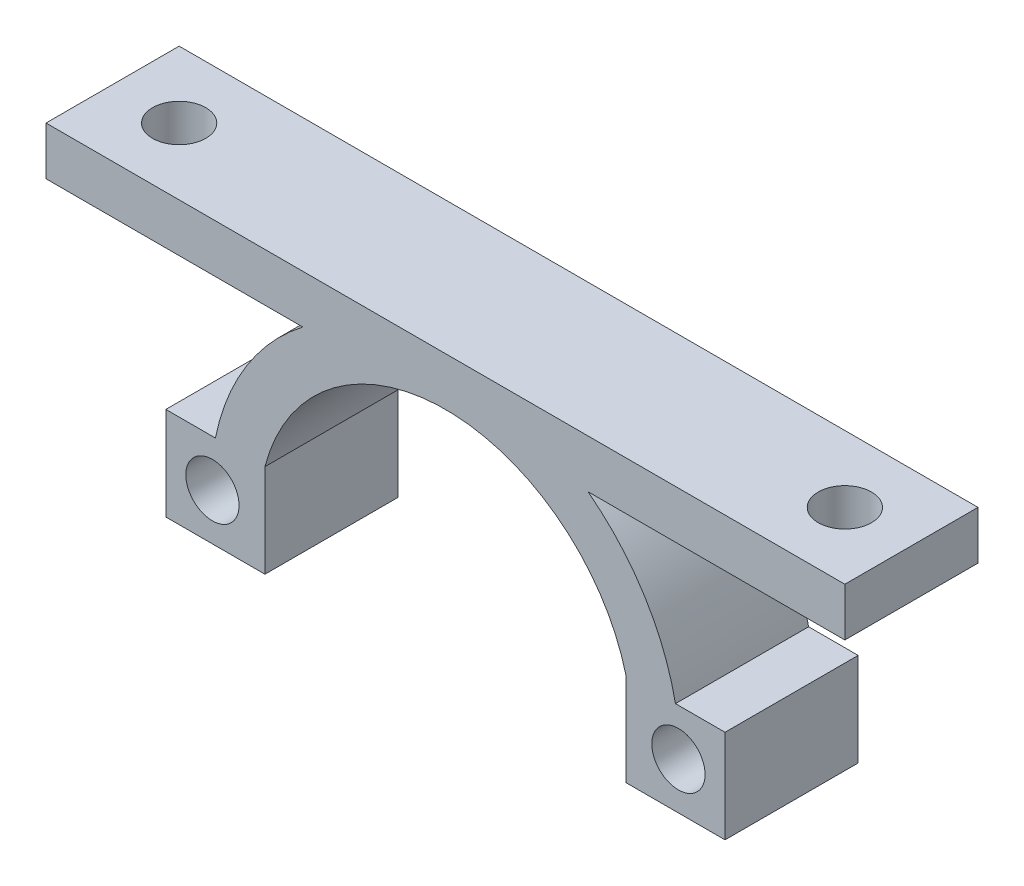
ISO-10303-21;
HEADER;
FILE_DESCRIPTION(('STEP AP214'),'2;1');
FILE_NAME('part.step','',(''),(''),'','','');
FILE_SCHEMA(('AUTOMOTIVE_DESIGN { 1 0 10303 214 1 1 1 1 }'));
ENDSEC;
DATA;
#1=APPLICATION_CONTEXT('core data for automotive mechanical design processes');
#2=APPLICATION_PROTOCOL_DEFINITION('international standard','automotive_design',2000,#1);
#3=PRODUCT_CONTEXT('',#1,'mechanical');
#4=PRODUCT('Part','Part','',(#3));
#5=PRODUCT_RELATED_PRODUCT_CATEGORY('part','',(#4));
#6=PRODUCT_DEFINITION_FORMATION('','',#4);
#7=PRODUCT_DEFINITION_CONTEXT('part definition',#1,'design');
#8=PRODUCT_DEFINITION('design','',#6,#7);
#9=PRODUCT_DEFINITION_SHAPE('','',#8);
#10=(LENGTH_UNIT() NAMED_UNIT(*) SI_UNIT(.MILLI.,.METRE.));
#11=(NAMED_UNIT(*) PLANE_ANGLE_UNIT() SI_UNIT($,.RADIAN.));
#12=(NAMED_UNIT(*) SI_UNIT($,.STERADIAN.) SOLID_ANGLE_UNIT());
#13=UNCERTAINTY_MEASURE_WITH_UNIT(LENGTH_MEASURE(1.E-05),#10,'distance_accuracy_value','');
#14=(GEOMETRIC_REPRESENTATION_CONTEXT(3) GLOBAL_UNCERTAINTY_ASSIGNED_CONTEXT((#13)) GLOBAL_UNIT_ASSIGNED_CONTEXT((#10,
#11,#12)) REPRESENTATION_CONTEXT('',''));
#15=CARTESIAN_POINT('',(0.,0.,0.));
#16=DIRECTION('',(0.,0.,1.));
#17=DIRECTION('',(1.,0.,0.));
#18=AXIS2_PLACEMENT_3D('',#15,#16,#17);
#19=CARTESIAN_POINT('',(0.,0.,10.));
#20=DIRECTION('',(0.,0.,-1.));
#21=DIRECTION('',(-1.,0.,0.));
#22=AXIS2_PLACEMENT_3D('',#19,#20,#21);
#23=CYLINDRICAL_SURFACE('',#22,17.6286595625737);
#24=DIRECTION('',(0.,0.,-1.));
#25=VECTOR('',#24,1.);
#26=CARTESIAN_POINT('',(10.7130592256891,14.,10.));
#27=LINE('',#26,#25);
#28=CARTESIAN_POINT('',(10.7130592256891,14.,10.));
#29=VERTEX_POINT('',#28);
#30=CARTESIAN_POINT('',(10.7130592256891,14.,0.));
#31=VERTEX_POINT('',#30);
#32=EDGE_CURVE('E60',#29,#31,#27,.T.);
#33=ORIENTED_EDGE('',*,*,#32,.F.);
#34=CARTESIAN_POINT('',(0.,0.,10.));
#35=DIRECTION('',(0.,0.,1.));
#36=DIRECTION('',(-1.,0.,0.));
#37=AXIS2_PLACEMENT_3D('',#34,#35,#36);
#38=CIRCLE('',#37,17.6286595625737);
#39=CARTESIAN_POINT('',(17.277720855863,3.5,10.));
#40=VERTEX_POINT('',#39);
#41=EDGE_CURVE('E208',#40,#29,#38,.T.);
#42=ORIENTED_EDGE('',*,*,#41,.F.);
#43=DIRECTION('',(0.,0.,-1.));
#44=VECTOR('',#43,1.);
#45=CARTESIAN_POINT('',(17.277720855863,3.5,10.));
#46=LINE('',#45,#44);
#47=CARTESIAN_POINT('',(17.277720855863,3.5,0.));
#48=VERTEX_POINT('',#47);
#49=EDGE_CURVE('E263',#40,#48,#46,.T.);
#50=ORIENTED_EDGE('',*,*,#49,.T.);
#51=CARTESIAN_POINT('',(0.,0.,0.));
#52=DIRECTION('',(0.,0.,1.));
#53=DIRECTION('',(-1.,0.,0.));
#54=AXIS2_PLACEMENT_3D('',#51,#52,#53);
#55=CIRCLE('',#54,17.6286595625737);
#56=EDGE_CURVE('E230',#48,#31,#55,.T.);
#57=ORIENTED_EDGE('',*,*,#56,.T.);
#58=EDGE_LOOP('',(#33,#42,#50,#57));
#59=FACE_BOUND('',#58,.T.);
#60=ADVANCED_FACE('F37',(#59),#23,.T.);
#61=DIRECTION('',(0.,0.,-1.));
#62=VECTOR('',#61,1.);
#63=CARTESIAN_POINT('',(-10.7130592256891,14.,10.));
#64=LINE('',#63,#62);
#65=CARTESIAN_POINT('',(-10.7130592256891,14.,0.));
#66=VERTEX_POINT('',#65);
#67=CARTESIAN_POINT('',(-10.7130592256891,14.,10.));
#68=VERTEX_POINT('',#67);
#69=EDGE_CURVE('E159',#66,#68,#64,.F.);
#70=ORIENTED_EDGE('',*,*,#69,.F.);
#71=CARTESIAN_POINT('',(-17.277720855863,3.5,0.));
#72=VERTEX_POINT('',#71);
#73=EDGE_CURVE('E229',#66,#72,#55,.T.);
#74=ORIENTED_EDGE('',*,*,#73,.T.);
#75=DIRECTION('',(0.,0.,-1.));
#76=VECTOR('',#75,1.);
#77=CARTESIAN_POINT('',(-17.277720855863,3.5,10.));
#78=LINE('',#77,#76);
#79=CARTESIAN_POINT('',(-17.277720855863,3.5,10.));
#80=VERTEX_POINT('',#79);
#81=EDGE_CURVE('E260',#80,#72,#78,.T.);
#82=ORIENTED_EDGE('',*,*,#81,.F.);
#83=EDGE_CURVE('E52',#68,#80,#38,.T.);
#84=ORIENTED_EDGE('',*,*,#83,.F.);
#85=EDGE_LOOP('',(#70,#74,#82,#84));
#86=FACE_BOUND('',#85,.T.);
#87=ADVANCED_FACE('F308',(#86),#23,.T.);
#88=CARTESIAN_POINT('',(0.,0.,10.));
#89=DIRECTION('',(0.,0.,-1.));
#90=DIRECTION('',(-1.,0.,0.));
#91=AXIS2_PLACEMENT_3D('',#88,#89,#90);
#92=PLANE('',#91);
#93=DIRECTION('',(1.,0.,0.));
#94=VECTOR('',#93,1.);
#95=CARTESIAN_POINT('',(-30.,14.,10.));
#96=LINE('',#95,#94);
#97=CARTESIAN_POINT('',(-30.,14.,10.));
#98=VERTEX_POINT('',#97);
#99=EDGE_CURVE('E152',#98,#68,#96,.T.);
#100=ORIENTED_EDGE('',*,*,#99,.T.);
#101=ORIENTED_EDGE('',*,*,#83,.T.);
#102=DIRECTION('',(-1.,0.,0.));
#103=VECTOR('',#102,1.);
#104=CARTESIAN_POINT('',(-17.277720855863,3.5,10.));
#105=LINE('',#104,#103);
#106=CARTESIAN_POINT('',(-21.,3.5,10.));
#107=VERTEX_POINT('',#106);
#108=EDGE_CURVE('E210',#80,#107,#105,.T.);
#109=ORIENTED_EDGE('',*,*,#108,.T.);
#110=DIRECTION('',(0.,-1.,0.));
#111=VECTOR('',#110,1.);
#112=CARTESIAN_POINT('',(-21.,3.5,10.));
#113=LINE('',#112,#111);
#114=CARTESIAN_POINT('',(-21.,-3.5,10.));
#115=VERTEX_POINT('',#114);
#116=EDGE_CURVE('E212',#107,#115,#113,.T.);
#117=ORIENTED_EDGE('',*,*,#116,.T.);
#118=DIRECTION('',(1.,0.,0.));
#119=VECTOR('',#118,1.);
#120=CARTESIAN_POINT('',(-13.555441711726,-3.5,10.));
#121=LINE('',#120,#119);
#122=CARTESIAN_POINT('',(-13.555441711726,-3.5,10.));
#123=VERTEX_POINT('',#122);
#124=EDGE_CURVE('E214',#115,#123,#121,.T.);
#125=ORIENTED_EDGE('',*,*,#124,.T.);
#126=DIRECTION('',(0.,1.,0.));
#127=VECTOR('',#126,1.);
#128=CARTESIAN_POINT('',(-13.555441711726,3.5,10.));
#129=LINE('',#128,#127);
#130=CARTESIAN_POINT('',(-13.555441711726,3.5,10.));
#131=VERTEX_POINT('',#130);
#132=EDGE_CURVE('E216',#123,#131,#129,.T.);
#133=ORIENTED_EDGE('',*,*,#132,.T.);
#134=CARTESIAN_POINT('',(0.,0.,10.));
#135=DIRECTION('',(0.,0.,-1.));
#136=DIRECTION('',(-1.,0.,0.));
#137=AXIS2_PLACEMENT_3D('',#134,#135,#136);
#138=CIRCLE('',#137,14.);
#139=CARTESIAN_POINT('',(13.555441711726,3.5,10.));
#140=VERTEX_POINT('',#139);
#141=EDGE_CURVE('E218',#131,#140,#138,.T.);
#142=ORIENTED_EDGE('',*,*,#141,.T.);
#143=DIRECTION('',(0.,-1.,0.));
#144=VECTOR('',#143,1.);
#145=CARTESIAN_POINT('',(13.555441711726,3.5,10.));
#146=LINE('',#145,#144);
#147=CARTESIAN_POINT('',(13.555441711726,-3.5,10.));
#148=VERTEX_POINT('',#147);
#149=EDGE_CURVE('E220',#140,#148,#146,.T.);
#150=ORIENTED_EDGE('',*,*,#149,.T.);
#151=DIRECTION('',(1.,0.,0.));
#152=VECTOR('',#151,1.);
#153=CARTESIAN_POINT('',(21.,-3.5,10.));
#154=LINE('',#153,#152);
#155=CARTESIAN_POINT('',(21.,-3.5,10.));
#156=VERTEX_POINT('',#155);
#157=EDGE_CURVE('E200',#148,#156,#154,.T.);
#158=ORIENTED_EDGE('',*,*,#157,.T.);
#159=DIRECTION('',(0.,1.,0.));
#160=VECTOR('',#159,1.);
#161=CARTESIAN_POINT('',(21.,3.5,10.));
#162=LINE('',#161,#160);
#163=CARTESIAN_POINT('',(21.,3.5,10.));
#164=VERTEX_POINT('',#163);
#165=EDGE_CURVE('E203',#156,#164,#162,.T.);
#166=ORIENTED_EDGE('',*,*,#165,.T.);
#167=DIRECTION('',(-1.,0.,0.));
#168=VECTOR('',#167,1.);
#169=CARTESIAN_POINT('',(17.277720855863,3.5,10.));
#170=LINE('',#169,#168);
#171=EDGE_CURVE('E206',#164,#40,#170,.T.);
#172=ORIENTED_EDGE('',*,*,#171,.T.);
#173=ORIENTED_EDGE('',*,*,#41,.T.);
#174=CARTESIAN_POINT('',(30.,14.,10.));
#175=VERTEX_POINT('',#174);
#176=EDGE_CURVE('E162',#29,#175,#96,.T.);
#177=ORIENTED_EDGE('',*,*,#176,.T.);
#178=DIRECTION('',(0.,1.,0.));
#179=VECTOR('',#178,1.);
#180=CARTESIAN_POINT('',(30.,17.6286595625737,10.));
#181=LINE('',#180,#179);
#182=CARTESIAN_POINT('',(30.,17.6286595625737,10.));
#183=VERTEX_POINT('',#182);
#184=EDGE_CURVE('E161',#175,#183,#181,.T.);
#185=ORIENTED_EDGE('',*,*,#184,.T.);
#186=DIRECTION('',(-1.,0.,0.));
#187=VECTOR('',#186,1.);
#188=CARTESIAN_POINT('',(-30.,17.6286595625737,10.));
#189=LINE('',#188,#187);
#190=CARTESIAN_POINT('',(-30.,17.6286595625737,10.));
#191=VERTEX_POINT('',#190);
#192=EDGE_CURVE('E169',#183,#191,#189,.T.);
#193=ORIENTED_EDGE('',*,*,#192,.T.);
#194=DIRECTION('',(0.,-1.,0.));
#195=VECTOR('',#194,1.);
#196=CARTESIAN_POINT('',(-30.,17.6286595625737,10.));
#197=LINE('',#196,#195);
#198=EDGE_CURVE('E165',#191,#98,#197,.T.);
#199=ORIENTED_EDGE('',*,*,#198,.T.);
#200=EDGE_LOOP('',(#100,#101,#109,#117,#125,#133,#142,#150,#158,#166,#172,#173,#177,#185,#193,#199));
#201=FACE_BOUND('',#200,.T.);
#202=CARTESIAN_POINT('',(17.5,0.,10.));
#203=DIRECTION('',(0.,0.,1.));
#204=DIRECTION('',(1.,0.,0.));
#205=AXIS2_PLACEMENT_3D('',#202,#203,#204);
#206=CIRCLE('',#205,2.);
#207=CARTESIAN_POINT('',(19.5,0.,10.));
#208=VERTEX_POINT('',#207);
#209=EDGE_CURVE('E188',#208,#208,#206,.T.);
#210=ORIENTED_EDGE('',*,*,#209,.F.);
#211=EDGE_LOOP('',(#210));
#212=FACE_BOUND('',#211,.T.);
#213=CARTESIAN_POINT('',(-17.5,0.,10.));
#214=DIRECTION('',(0.,0.,1.));
#215=DIRECTION('',(1.,0.,0.));
#216=AXIS2_PLACEMENT_3D('',#213,#214,#215);
#217=CIRCLE('',#216,2.);
#218=CARTESIAN_POINT('',(-15.5,0.,10.));
#219=VERTEX_POINT('',#218);
#220=EDGE_CURVE('E194',#219,#219,#217,.T.);
#221=ORIENTED_EDGE('',*,*,#220,.F.);
#222=EDGE_LOOP('',(#221));
#223=FACE_BOUND('',#222,.T.);
#224=ADVANCED_FACE('F166',(#201,#212,#223),#92,.F.);
#225=CARTESIAN_POINT('',(0.,0.,0.));
#226=DIRECTION('',(0.,0.,-1.));
#227=DIRECTION('',(-1.,0.,0.));
#228=AXIS2_PLACEMENT_3D('',#225,#226,#227);
#229=PLANE('',#228);
#230=DIRECTION('',(0.,-1.,0.));
#231=VECTOR('',#230,1.);
#232=CARTESIAN_POINT('',(13.555441711726,3.5,0.));
#233=LINE('',#232,#231);
#234=CARTESIAN_POINT('',(13.555441711726,3.5,0.));
#235=VERTEX_POINT('',#234);
#236=CARTESIAN_POINT('',(13.555441711726,-3.5,0.));
#237=VERTEX_POINT('',#236);
#238=EDGE_CURVE('E204',#235,#237,#233,.T.);
#239=ORIENTED_EDGE('',*,*,#238,.F.);
#240=CARTESIAN_POINT('',(0.,0.,0.));
#241=DIRECTION('',(0.,0.,-1.));
#242=DIRECTION('',(-1.,0.,0.));
#243=AXIS2_PLACEMENT_3D('',#240,#241,#242);
#244=CIRCLE('',#243,14.);
#245=CARTESIAN_POINT('',(-13.555441711726,3.5,0.));
#246=VERTEX_POINT('',#245);
#247=EDGE_CURVE('E240',#246,#235,#244,.T.);
#248=ORIENTED_EDGE('',*,*,#247,.F.);
#249=DIRECTION('',(0.,1.,0.));
#250=VECTOR('',#249,1.);
#251=CARTESIAN_POINT('',(-13.555441711726,3.5,0.));
#252=LINE('',#251,#250);
#253=CARTESIAN_POINT('',(-13.555441711726,-3.5,0.));
#254=VERTEX_POINT('',#253);
#255=EDGE_CURVE('E238',#254,#246,#252,.T.);
#256=ORIENTED_EDGE('',*,*,#255,.F.);
#257=DIRECTION('',(1.,0.,0.));
#258=VECTOR('',#257,1.);
#259=CARTESIAN_POINT('',(-13.555441711726,-3.5,0.));
#260=LINE('',#259,#258);
#261=CARTESIAN_POINT('',(-21.,-3.5,0.));
#262=VERTEX_POINT('',#261);
#263=EDGE_CURVE('E236',#262,#254,#260,.T.);
#264=ORIENTED_EDGE('',*,*,#263,.F.);
#265=DIRECTION('',(0.,-1.,0.));
#266=VECTOR('',#265,1.);
#267=CARTESIAN_POINT('',(-21.,3.5,0.));
#268=LINE('',#267,#266);
#269=CARTESIAN_POINT('',(-21.,3.5,0.));
#270=VERTEX_POINT('',#269);
#271=EDGE_CURVE('E234',#270,#262,#268,.T.);
#272=ORIENTED_EDGE('',*,*,#271,.F.);
#273=DIRECTION('',(-1.,0.,0.));
#274=VECTOR('',#273,1.);
#275=CARTESIAN_POINT('',(-17.277720855863,3.5,0.));
#276=LINE('',#275,#274);
#277=EDGE_CURVE('E232',#72,#270,#276,.T.);
#278=ORIENTED_EDGE('',*,*,#277,.F.);
#279=ORIENTED_EDGE('',*,*,#73,.F.);
#280=DIRECTION('',(1.,0.,0.));
#281=VECTOR('',#280,1.);
#282=CARTESIAN_POINT('',(-30.,14.,0.));
#283=LINE('',#282,#281);
#284=CARTESIAN_POINT('',(-30.,14.,0.));
#285=VERTEX_POINT('',#284);
#286=EDGE_CURVE('E294',#285,#66,#283,.T.);
#287=ORIENTED_EDGE('',*,*,#286,.F.);
#288=DIRECTION('',(0.,-1.,0.));
#289=VECTOR('',#288,1.);
#290=CARTESIAN_POINT('',(-30.,17.6286595625737,0.));
#291=LINE('',#290,#289);
#292=CARTESIAN_POINT('',(-30.,17.6286595625737,0.));
#293=VERTEX_POINT('',#292);
#294=EDGE_CURVE('E177',#293,#285,#291,.T.);
#295=ORIENTED_EDGE('',*,*,#294,.F.);
#296=DIRECTION('',(-1.,0.,0.));
#297=VECTOR('',#296,1.);
#298=CARTESIAN_POINT('',(-30.,17.6286595625737,0.));
#299=LINE('',#298,#297);
#300=CARTESIAN_POINT('',(30.,17.6286595625737,0.));
#301=VERTEX_POINT('',#300);
#302=EDGE_CURVE('E173',#301,#293,#299,.T.);
#303=ORIENTED_EDGE('',*,*,#302,.F.);
#304=DIRECTION('',(0.,1.,0.));
#305=VECTOR('',#304,1.);
#306=CARTESIAN_POINT('',(30.,17.6286595625737,0.));
#307=LINE('',#306,#305);
#308=CARTESIAN_POINT('',(30.,14.,0.));
#309=VERTEX_POINT('',#308);
#310=EDGE_CURVE('E296',#309,#301,#307,.T.);
#311=ORIENTED_EDGE('',*,*,#310,.F.);
#312=EDGE_CURVE('E281',#31,#309,#283,.T.);
#313=ORIENTED_EDGE('',*,*,#312,.F.);
#314=ORIENTED_EDGE('',*,*,#56,.F.);
#315=DIRECTION('',(-1.,0.,0.));
#316=VECTOR('',#315,1.);
#317=CARTESIAN_POINT('',(17.277720855863,3.5,0.));
#318=LINE('',#317,#316);
#319=CARTESIAN_POINT('',(21.,3.5,0.));
#320=VERTEX_POINT('',#319);
#321=EDGE_CURVE('E227',#320,#48,#318,.T.);
#322=ORIENTED_EDGE('',*,*,#321,.F.);
#323=DIRECTION('',(0.,1.,0.));
#324=VECTOR('',#323,1.);
#325=CARTESIAN_POINT('',(21.,3.5,0.));
#326=LINE('',#325,#324);
#327=CARTESIAN_POINT('',(21.,-3.5,0.));
#328=VERTEX_POINT('',#327);
#329=EDGE_CURVE('E225',#328,#320,#326,.T.);
#330=ORIENTED_EDGE('',*,*,#329,.F.);
#331=DIRECTION('',(1.,0.,0.));
#332=VECTOR('',#331,1.);
#333=CARTESIAN_POINT('',(21.,-3.5,0.));
#334=LINE('',#333,#332);
#335=EDGE_CURVE('E197',#237,#328,#334,.T.);
#336=ORIENTED_EDGE('',*,*,#335,.F.);
#337=EDGE_LOOP('',(#239,#248,#256,#264,#272,#278,#279,#287,#295,#303,#311,#313,#314,#322,#330,#336));
#338=FACE_BOUND('',#337,.T.);
#339=CARTESIAN_POINT('',(17.5,0.,0.));
#340=DIRECTION('',(0.,0.,1.));
#341=DIRECTION('',(1.,0.,0.));
#342=AXIS2_PLACEMENT_3D('',#339,#340,#341);
#343=CIRCLE('',#342,2.);
#344=CARTESIAN_POINT('',(19.5,0.,0.));
#345=VERTEX_POINT('',#344);
#346=EDGE_CURVE('E187',#345,#345,#343,.T.);
#347=ORIENTED_EDGE('',*,*,#346,.T.);
#348=EDGE_LOOP('',(#347));
#349=FACE_BOUND('',#348,.T.);
#350=CARTESIAN_POINT('',(-17.5,0.,0.));
#351=DIRECTION('',(0.,0.,1.));
#352=DIRECTION('',(1.,0.,0.));
#353=AXIS2_PLACEMENT_3D('',#350,#351,#352);
#354=CIRCLE('',#353,2.);
#355=CARTESIAN_POINT('',(-15.5,0.,0.));
#356=VERTEX_POINT('',#355);
#357=EDGE_CURVE('E191',#356,#356,#354,.T.);
#358=ORIENTED_EDGE('',*,*,#357,.T.);
#359=EDGE_LOOP('',(#358));
#360=FACE_BOUND('',#359,.T.);
#361=ADVANCED_FACE('F276',(#338,#349,#360),#229,.T.);
#362=CARTESIAN_POINT('',(21.,-3.5,10.));
#363=DIRECTION('',(0.,1.,0.));
#364=DIRECTION('',(-1.,0.,0.));
#365=AXIS2_PLACEMENT_3D('',#362,#363,#364);
#366=PLANE('',#365);
#367=ORIENTED_EDGE('',*,*,#335,.T.);
#368=DIRECTION('',(0.,0.,-1.));
#369=VECTOR('',#368,1.);
#370=CARTESIAN_POINT('',(21.,-3.5,10.));
#371=LINE('',#370,#369);
#372=EDGE_CURVE('E11',#156,#328,#371,.T.);
#373=ORIENTED_EDGE('',*,*,#372,.F.);
#374=ORIENTED_EDGE('',*,*,#157,.F.);
#375=DIRECTION('',(0.,0.,-1.));
#376=VECTOR('',#375,1.);
#377=CARTESIAN_POINT('',(13.555441711726,-3.5,10.));
#378=LINE('',#377,#376);
#379=EDGE_CURVE('E222',#148,#237,#378,.T.);
#380=ORIENTED_EDGE('',*,*,#379,.T.);
#381=EDGE_LOOP('',(#367,#373,#374,#380));
#382=FACE_BOUND('',#381,.T.);
#383=ADVANCED_FACE('F39',(#382),#366,.F.);
#384=CARTESIAN_POINT('',(21.,3.5,10.));
#385=DIRECTION('',(-1.,0.,0.));
#386=DIRECTION('',(0.,0.,1.));
#387=AXIS2_PLACEMENT_3D('',#384,#385,#386);
#388=PLANE('',#387);
#389=ORIENTED_EDGE('',*,*,#329,.T.);
#390=DIRECTION('',(0.,0.,-1.));
#391=VECTOR('',#390,1.);
#392=CARTESIAN_POINT('',(21.,3.5,10.));
#393=LINE('',#392,#391);
#394=EDGE_CURVE('E45',#164,#320,#393,.T.);
#395=ORIENTED_EDGE('',*,*,#394,.F.);
#396=ORIENTED_EDGE('',*,*,#165,.F.);
#397=ORIENTED_EDGE('',*,*,#372,.T.);
#398=EDGE_LOOP('',(#389,#395,#396,#397));
#399=FACE_BOUND('',#398,.T.);
#400=ADVANCED_FACE('F321',(#399),#388,.F.);
#401=CARTESIAN_POINT('',(17.277720855863,3.5,10.));
#402=DIRECTION('',(0.,-1.,0.));
#403=DIRECTION('',(1.,0.,0.));
#404=AXIS2_PLACEMENT_3D('',#401,#402,#403);
#405=PLANE('',#404);
#406=ORIENTED_EDGE('',*,*,#321,.T.);
#407=ORIENTED_EDGE('',*,*,#49,.F.);
#408=ORIENTED_EDGE('',*,*,#171,.F.);
#409=ORIENTED_EDGE('',*,*,#394,.T.);
#410=EDGE_LOOP('',(#406,#407,#408,#409));
#411=FACE_BOUND('',#410,.T.);
#412=ADVANCED_FACE('F270',(#411),#405,.F.);
#413=CARTESIAN_POINT('',(-17.277720855863,3.5,10.));
#414=DIRECTION('',(0.,-1.,0.));
#415=DIRECTION('',(0.,0.,-1.));
#416=AXIS2_PLACEMENT_3D('',#413,#414,#415);
#417=PLANE('',#416);
#418=ORIENTED_EDGE('',*,*,#277,.T.);
#419=DIRECTION('',(0.,0.,-1.));
#420=VECTOR('',#419,1.);
#421=CARTESIAN_POINT('',(-21.,3.5,10.));
#422=LINE('',#421,#420);
#423=EDGE_CURVE('E257',#107,#270,#422,.T.);
#424=ORIENTED_EDGE('',*,*,#423,.F.);
#425=ORIENTED_EDGE('',*,*,#108,.F.);
#426=ORIENTED_EDGE('',*,*,#81,.T.);
#427=EDGE_LOOP('',(#418,#424,#425,#426));
#428=FACE_BOUND('',#427,.T.);
#429=ADVANCED_FACE('F318',(#428),#417,.F.);
#430=CARTESIAN_POINT('',(-21.,3.5,10.));
#431=DIRECTION('',(1.,0.,0.));
#432=DIRECTION('',(0.,0.,-1.));
#433=AXIS2_PLACEMENT_3D('',#430,#431,#432);
#434=PLANE('',#433);
#435=ORIENTED_EDGE('',*,*,#271,.T.);
#436=DIRECTION('',(0.,0.,-1.));
#437=VECTOR('',#436,1.);
#438=CARTESIAN_POINT('',(-21.,-3.5,10.));
#439=LINE('',#438,#437);
#440=EDGE_CURVE('E254',#115,#262,#439,.T.);
#441=ORIENTED_EDGE('',*,*,#440,.F.);
#442=ORIENTED_EDGE('',*,*,#116,.F.);
#443=ORIENTED_EDGE('',*,*,#423,.T.);
#444=EDGE_LOOP('',(#435,#441,#442,#443));
#445=FACE_BOUND('',#444,.T.);
#446=ADVANCED_FACE('F351',(#445),#434,.F.);
#447=CARTESIAN_POINT('',(-13.555441711726,-3.5,10.));
#448=DIRECTION('',(0.,1.,0.));
#449=DIRECTION('',(-1.,0.,0.));
#450=AXIS2_PLACEMENT_3D('',#447,#448,#449);
#451=PLANE('',#450);
#452=ORIENTED_EDGE('',*,*,#263,.T.);
#453=DIRECTION('',(0.,0.,-1.));
#454=VECTOR('',#453,1.);
#455=CARTESIAN_POINT('',(-13.555441711726,-3.5,10.));
#456=LINE('',#455,#454);
#457=EDGE_CURVE('E251',#123,#254,#456,.T.);
#458=ORIENTED_EDGE('',*,*,#457,.F.);
#459=ORIENTED_EDGE('',*,*,#124,.F.);
#460=ORIENTED_EDGE('',*,*,#440,.T.);
#461=EDGE_LOOP('',(#452,#458,#459,#460));
#462=FACE_BOUND('',#461,.T.);
#463=ADVANCED_FACE('F346',(#462),#451,.F.);
#464=CARTESIAN_POINT('',(-13.555441711726,3.5,10.));
#465=DIRECTION('',(-1.,0.,0.));
#466=DIRECTION('',(0.,0.,1.));
#467=AXIS2_PLACEMENT_3D('',#464,#465,#466);
#468=PLANE('',#467);
#469=ORIENTED_EDGE('',*,*,#255,.T.);
#470=DIRECTION('',(0.,0.,-1.));
#471=VECTOR('',#470,1.);
#472=CARTESIAN_POINT('',(-13.555441711726,3.5,10.));
#473=LINE('',#472,#471);
#474=EDGE_CURVE('E248',#131,#246,#473,.T.);
#475=ORIENTED_EDGE('',*,*,#474,.F.);
#476=ORIENTED_EDGE('',*,*,#132,.F.);
#477=ORIENTED_EDGE('',*,*,#457,.T.);
#478=EDGE_LOOP('',(#469,#475,#476,#477));
#479=FACE_BOUND('',#478,.T.);
#480=ADVANCED_FACE('F342',(#479),#468,.F.);
#481=CARTESIAN_POINT('',(0.,0.,10.));
#482=DIRECTION('',(0.,0.,-1.));
#483=DIRECTION('',(-1.,0.,0.));
#484=AXIS2_PLACEMENT_3D('',#481,#482,#483);
#485=CYLINDRICAL_SURFACE('',#484,14.);
#486=ORIENTED_EDGE('',*,*,#247,.T.);
#487=DIRECTION('',(0.,0.,-1.));
#488=VECTOR('',#487,1.);
#489=CARTESIAN_POINT('',(13.555441711726,3.5,10.));
#490=LINE('',#489,#488);
#491=EDGE_CURVE('E245',#140,#235,#490,.T.);
#492=ORIENTED_EDGE('',*,*,#491,.F.);
#493=ORIENTED_EDGE('',*,*,#141,.F.);
#494=ORIENTED_EDGE('',*,*,#474,.T.);
#495=EDGE_LOOP('',(#486,#492,#493,#494));
#496=FACE_BOUND('',#495,.T.);
#497=ADVANCED_FACE('F338',(#496),#485,.F.);
#498=CARTESIAN_POINT('',(13.555441711726,3.5,10.));
#499=DIRECTION('',(1.,0.,0.));
#500=DIRECTION('',(0.,0.,-1.));
#501=AXIS2_PLACEMENT_3D('',#498,#499,#500);
#502=PLANE('',#501);
#503=ORIENTED_EDGE('',*,*,#238,.T.);
#504=ORIENTED_EDGE('',*,*,#379,.F.);
#505=ORIENTED_EDGE('',*,*,#149,.F.);
#506=ORIENTED_EDGE('',*,*,#491,.T.);
#507=EDGE_LOOP('',(#503,#504,#505,#506));
#508=FACE_BOUND('',#507,.T.);
#509=ADVANCED_FACE('F333',(#508),#502,.F.);
#510=CARTESIAN_POINT('',(-17.5,0.,10.));
#511=DIRECTION('',(0.,0.,-1.));
#512=DIRECTION('',(-1.,0.,0.));
#513=AXIS2_PLACEMENT_3D('',#510,#511,#512);
#514=CYLINDRICAL_SURFACE('',#513,2.);
#515=ORIENTED_EDGE('',*,*,#220,.T.);
#516=EDGE_LOOP('',(#515));
#517=FACE_BOUND('',#516,.T.);
#518=ORIENTED_EDGE('',*,*,#357,.F.);
#519=EDGE_LOOP('',(#518));
#520=FACE_BOUND('',#519,.T.);
#521=ADVANCED_FACE('F370',(#517,#520),#514,.F.);
#522=CARTESIAN_POINT('',(17.5,0.,10.));
#523=DIRECTION('',(0.,0.,-1.));
#524=DIRECTION('',(-1.,0.,0.));
#525=AXIS2_PLACEMENT_3D('',#522,#523,#524);
#526=CYLINDRICAL_SURFACE('',#525,2.);
#527=ORIENTED_EDGE('',*,*,#209,.T.);
#528=EDGE_LOOP('',(#527));
#529=FACE_BOUND('',#528,.T.);
#530=ORIENTED_EDGE('',*,*,#346,.F.);
#531=EDGE_LOOP('',(#530));
#532=FACE_BOUND('',#531,.T.);
#533=ADVANCED_FACE('F375',(#529,#532),#526,.F.);
#534=CARTESIAN_POINT('',(-30.,17.6286595625737,10.));
#535=DIRECTION('',(0.,-1.,0.));
#536=DIRECTION('',(1.,0.,0.));
#537=AXIS2_PLACEMENT_3D('',#534,#535,#536);
#538=PLANE('',#537);
#539=CARTESIAN_POINT('',(-25.,17.6286595625737,5.00000000000001));
#540=DIRECTION('',(0.,1.,0.));
#541=DIRECTION('',(-1.,0.,0.));
#542=AXIS2_PLACEMENT_3D('',#539,#540,#541);
#543=CIRCLE('',#542,2.);
#544=CARTESIAN_POINT('',(-27.,17.6286595625737,5.00000000000001));
#545=VERTEX_POINT('',#544);
#546=EDGE_CURVE('E402',#545,#545,#543,.T.);
#547=ORIENTED_EDGE('',*,*,#546,.F.);
#548=EDGE_LOOP('',(#547));
#549=FACE_BOUND('',#548,.T.);
#550=CARTESIAN_POINT('',(25.,17.6286595625737,5.00000000000001));
#551=DIRECTION('',(0.,1.,0.));
#552=DIRECTION('',(-1.,0.,0.));
#553=AXIS2_PLACEMENT_3D('',#550,#551,#552);
#554=CIRCLE('',#553,2.);
#555=CARTESIAN_POINT('',(23.,17.6286595625737,5.00000000000001));
#556=VERTEX_POINT('',#555);
#557=EDGE_CURVE('E407',#556,#556,#554,.T.);
#558=ORIENTED_EDGE('',*,*,#557,.F.);
#559=EDGE_LOOP('',(#558));
#560=FACE_BOUND('',#559,.T.);
#561=DIRECTION('',(0.,0.,-1.));
#562=VECTOR('',#561,1.);
#563=CARTESIAN_POINT('',(-30.,17.6286595625737,10.));
#564=LINE('',#563,#562);
#565=EDGE_CURVE('E291',#191,#293,#564,.T.);
#566=ORIENTED_EDGE('',*,*,#565,.F.);
#567=ORIENTED_EDGE('',*,*,#192,.F.);
#568=DIRECTION('',(0.,0.,-1.));
#569=VECTOR('',#568,1.);
#570=CARTESIAN_POINT('',(30.,17.6286595625737,10.));
#571=LINE('',#570,#569);
#572=EDGE_CURVE('E182',#183,#301,#571,.T.);
#573=ORIENTED_EDGE('',*,*,#572,.T.);
#574=ORIENTED_EDGE('',*,*,#302,.T.);
#575=EDGE_LOOP('',(#566,#567,#573,#574));
#576=FACE_BOUND('',#575,.T.);
#577=ADVANCED_FACE('F303',(#549,#560,#576),#538,.F.);
#578=CARTESIAN_POINT('',(-30.,14.,10.));
#579=DIRECTION('',(0.,1.,0.));
#580=DIRECTION('',(-1.,0.,0.));
#581=AXIS2_PLACEMENT_3D('',#578,#579,#580);
#582=PLANE('',#581);
#583=CARTESIAN_POINT('',(25.,14.,5.00000000000001));
#584=DIRECTION('',(0.,1.,0.));
#585=DIRECTION('',(-1.,0.,0.));
#586=AXIS2_PLACEMENT_3D('',#583,#584,#585);
#587=CIRCLE('',#586,2.);
#588=CARTESIAN_POINT('',(23.,14.,5.00000000000001));
#589=VERTEX_POINT('',#588);
#590=EDGE_CURVE('E410',#589,#589,#587,.F.);
#591=ORIENTED_EDGE('',*,*,#590,.F.);
#592=EDGE_LOOP('',(#591));
#593=FACE_BOUND('',#592,.T.);
#594=ORIENTED_EDGE('',*,*,#176,.F.);
#595=ORIENTED_EDGE('',*,*,#32,.T.);
#596=ORIENTED_EDGE('',*,*,#312,.T.);
#597=DIRECTION('',(0.,0.,-1.));
#598=VECTOR('',#597,1.);
#599=CARTESIAN_POINT('',(30.,14.,10.));
#600=LINE('',#599,#598);
#601=EDGE_CURVE('E178',#175,#309,#600,.T.);
#602=ORIENTED_EDGE('',*,*,#601,.F.);
#603=EDGE_LOOP('',(#594,#595,#596,#602));
#604=FACE_BOUND('',#603,.T.);
#605=ADVANCED_FACE('F284',(#593,#604),#582,.F.);
#606=CARTESIAN_POINT('',(-25.,14.,5.00000000000001));
#607=DIRECTION('',(0.,1.,0.));
#608=DIRECTION('',(-1.,0.,0.));
#609=AXIS2_PLACEMENT_3D('',#606,#607,#608);
#610=CIRCLE('',#609,2.);
#611=CARTESIAN_POINT('',(-27.,14.,5.00000000000001));
#612=VERTEX_POINT('',#611);
#613=EDGE_CURVE('E293',#612,#612,#610,.F.);
#614=ORIENTED_EDGE('',*,*,#613,.F.);
#615=EDGE_LOOP('',(#614));
#616=FACE_BOUND('',#615,.T.);
#617=ORIENTED_EDGE('',*,*,#286,.T.);
#618=ORIENTED_EDGE('',*,*,#69,.T.);
#619=ORIENTED_EDGE('',*,*,#99,.F.);
#620=DIRECTION('',(0.,0.,-1.));
#621=VECTOR('',#620,1.);
#622=CARTESIAN_POINT('',(-30.,14.,10.));
#623=LINE('',#622,#621);
#624=EDGE_CURVE('E157',#98,#285,#623,.T.);
#625=ORIENTED_EDGE('',*,*,#624,.T.);
#626=EDGE_LOOP('',(#617,#618,#619,#625));
#627=FACE_BOUND('',#626,.T.);
#628=ADVANCED_FACE('F155',(#616,#627),#582,.F.);
#629=CARTESIAN_POINT('',(-30.,17.6286595625737,10.));
#630=DIRECTION('',(1.,0.,0.));
#631=DIRECTION('',(0.,0.,-1.));
#632=AXIS2_PLACEMENT_3D('',#629,#630,#631);
#633=PLANE('',#632);
#634=ORIENTED_EDGE('',*,*,#294,.T.);
#635=ORIENTED_EDGE('',*,*,#624,.F.);
#636=ORIENTED_EDGE('',*,*,#198,.F.);
#637=ORIENTED_EDGE('',*,*,#565,.T.);
#638=EDGE_LOOP('',(#634,#635,#636,#637));
#639=FACE_BOUND('',#638,.T.);
#640=ADVANCED_FACE('F175',(#639),#633,.F.);
#641=CARTESIAN_POINT('',(30.,17.6286595625737,10.));
#642=DIRECTION('',(-1.,0.,0.));
#643=DIRECTION('',(0.,0.,1.));
#644=AXIS2_PLACEMENT_3D('',#641,#642,#643);
#645=PLANE('',#644);
#646=ORIENTED_EDGE('',*,*,#310,.T.);
#647=ORIENTED_EDGE('',*,*,#572,.F.);
#648=ORIENTED_EDGE('',*,*,#184,.F.);
#649=ORIENTED_EDGE('',*,*,#601,.T.);
#650=EDGE_LOOP('',(#646,#647,#648,#649));
#651=FACE_BOUND('',#650,.T.);
#652=ADVANCED_FACE('F305',(#651),#645,.F.);
#653=CARTESIAN_POINT('',(-25.,-3.50100000000001,5.00000000000001));
#654=DIRECTION('',(0.,1.,0.));
#655=DIRECTION('',(-1.,0.,0.));
#656=AXIS2_PLACEMENT_3D('',#653,#654,#655);
#657=CYLINDRICAL_SURFACE('',#656,2.);
#658=ORIENTED_EDGE('',*,*,#546,.T.);
#659=EDGE_LOOP('',(#658));
#660=FACE_BOUND('',#659,.T.);
#661=ORIENTED_EDGE('',*,*,#613,.T.);
#662=EDGE_LOOP('',(#661));
#663=FACE_BOUND('',#662,.T.);
#664=ADVANCED_FACE('F387',(#660,#663),#657,.F.);
#665=CARTESIAN_POINT('',(25.,-3.501,5.00000000000001));
#666=DIRECTION('',(0.,1.,0.));
#667=DIRECTION('',(-1.,0.,0.));
#668=AXIS2_PLACEMENT_3D('',#665,#666,#667);
#669=CYLINDRICAL_SURFACE('',#668,2.);
#670=ORIENTED_EDGE('',*,*,#557,.T.);
#671=EDGE_LOOP('',(#670));
#672=FACE_BOUND('',#671,.T.);
#673=ORIENTED_EDGE('',*,*,#590,.T.);
#674=EDGE_LOOP('',(#673));
#675=FACE_BOUND('',#674,.T.);
#676=ADVANCED_FACE('F391',(#672,#675),#669,.F.);
#677=CLOSED_SHELL('',(#60,#87,#224,#361,#383,#400,#412,#429,#446,#463,#480,#497,#509,#521,#533,
#577,#605,#628,#640,#652,#664,#676));
#678=MANIFOLD_SOLID_BREP('B2',#677);
#679=ADVANCED_BREP_SHAPE_REPRESENTATION('',(#18,#678),#14);
#680=SHAPE_DEFINITION_REPRESENTATION(#9,#679);
ENDSEC;
END-ISO-10303-21;
